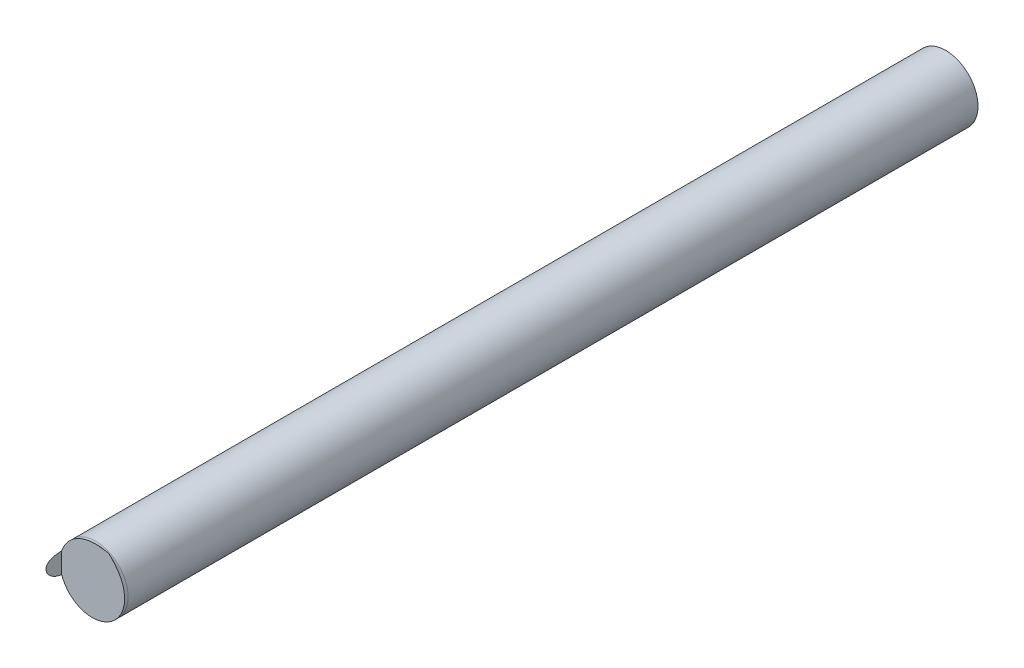
ISO-10303-21;
HEADER;
FILE_DESCRIPTION(('STEP AP214'),'2;1');
FILE_NAME('part.step','',(''),(''),'','','');
FILE_SCHEMA(('AUTOMOTIVE_DESIGN { 1 0 10303 214 1 1 1 1 }'));
ENDSEC;
DATA;
#1=APPLICATION_CONTEXT('core data for automotive mechanical design processes');
#2=APPLICATION_PROTOCOL_DEFINITION('international standard','automotive_design',2000,#1);
#3=PRODUCT_CONTEXT('',#1,'mechanical');
#4=PRODUCT('Part','Part','',(#3));
#5=PRODUCT_RELATED_PRODUCT_CATEGORY('part','',(#4));
#6=PRODUCT_DEFINITION_FORMATION('','',#4);
#7=PRODUCT_DEFINITION_CONTEXT('part definition',#1,'design');
#8=PRODUCT_DEFINITION('design','',#6,#7);
#9=PRODUCT_DEFINITION_SHAPE('','',#8);
#10=(LENGTH_UNIT() NAMED_UNIT(*) SI_UNIT(.MILLI.,.METRE.));
#11=(NAMED_UNIT(*) PLANE_ANGLE_UNIT() SI_UNIT($,.RADIAN.));
#12=(NAMED_UNIT(*) SI_UNIT($,.STERADIAN.) SOLID_ANGLE_UNIT());
#13=UNCERTAINTY_MEASURE_WITH_UNIT(LENGTH_MEASURE(1.E-05),#10,'distance_accuracy_value','');
#14=(GEOMETRIC_REPRESENTATION_CONTEXT(3) GLOBAL_UNCERTAINTY_ASSIGNED_CONTEXT((#13)) GLOBAL_UNIT_ASSIGNED_CONTEXT((#10,
#11,#12)) REPRESENTATION_CONTEXT('',''));
#15=CARTESIAN_POINT('',(0.,0.,0.));
#16=DIRECTION('',(0.,0.,1.));
#17=DIRECTION('',(1.,0.,0.));
#18=AXIS2_PLACEMENT_3D('',#15,#16,#17);
#19=CARTESIAN_POINT('',(-2.52706250659335,0.304851094896286,-7.3152));
#20=DIRECTION('',(0.,0.,-1.));
#21=DIRECTION('',(-1.,0.,0.));
#22=AXIS2_PLACEMENT_3D('',#19,#20,#21);
#23=PLANE('',#22);
#24=CARTESIAN_POINT('',(-2.52706250659335,0.304851094896286,-7.3152));
#25=DIRECTION('',(0.,0.,1.));
#26=DIRECTION('',(0.467775560933805,0.88384728578701,0.));
#27=AXIS2_PLACEMENT_3D('',#24,#25,#26);
#28=CIRCLE('',#27,0.2286);
#29=CARTESIAN_POINT('',(-2.42012901336388,0.506898584427196,-7.3152));
#30=VERTEX_POINT('',#29);
#31=EDGE_CURVE('E51',#30,#30,#28,.T.);
#32=ORIENTED_EDGE('',*,*,#31,.F.);
#33=EDGE_LOOP('',(#32));
#34=FACE_BOUND('',#33,.T.);
#35=ADVANCED_FACE('F16',(#34),#23,.T.);
#36=CARTESIAN_POINT('',(-2.52706250659335,0.304851094896286,-1.175004));
#37=DIRECTION('',(0.,0.,1.));
#38=DIRECTION('',(1.,0.,0.));
#39=AXIS2_PLACEMENT_3D('',#36,#37,#38);
#40=CYLINDRICAL_SURFACE('',#39,0.2286);
#41=CARTESIAN_POINT('',(-2.52706250659335,0.304851094896286,-1.2954));
#42=DIRECTION('',(0.,0.,1.));
#43=DIRECTION('',(-0.467775560933805,-0.88384728578701,0.));
#44=AXIS2_PLACEMENT_3D('',#41,#42,#43);
#45=CIRCLE('',#44,0.2286);
#46=CARTESIAN_POINT('',(-2.63399599982282,0.102803605365376,-1.2954));
#47=VERTEX_POINT('',#46);
#48=EDGE_CURVE('E48',#47,#47,#45,.T.);
#49=ORIENTED_EDGE('',*,*,#48,.F.);
#50=EDGE_LOOP('',(#49));
#51=FACE_BOUND('',#50,.T.);
#52=ORIENTED_EDGE('',*,*,#31,.T.);
#53=EDGE_LOOP('',(#52));
#54=FACE_BOUND('',#53,.T.);
#55=ADVANCED_FACE('F79',(#51,#54),#40,.T.);
#56=CARTESIAN_POINT('',(-2.7432,0.305444522718064,-1.21433725593099));
#57=DIRECTION('',(1.,0.,0.));
#58=DIRECTION('',(0.,0.,-1.));
#59=AXIS2_PLACEMENT_3D('',#56,#57,#58);
#60=PLANE('',#59);
#61=DIRECTION('',(1.44277346675194E-06,-0.999999999998959,0.));
#62=VECTOR('',#61,1.);
#63=CARTESIAN_POINT('',(-2.7432,0.378755047888186,-1.27));
#64=LINE('',#63,#62);
#65=CARTESIAN_POINT('',(-2.7432,0.378755047888186,-1.27));
#66=VERTEX_POINT('',#65);
#67=CARTESIAN_POINT('',(-2.74319978845864,0.232134069019859,-1.27));
#68=VERTEX_POINT('',#67);
#69=EDGE_CURVE('E29',#66,#68,#64,.T.);
#70=ORIENTED_EDGE('',*,*,#69,.F.);
#71=CARTESIAN_POINT('',(-2.7432,0.378755047888186,-1.27));
#72=CARTESIAN_POINT('',(-2.7432,0.378449336977638,-1.26306822146201));
#73=CARTESIAN_POINT('',(-2.7432,0.377593387648138,-1.24996852876635));
#74=CARTESIAN_POINT('',(-2.7432,0.375619090815434,-1.23269632173501));
#75=CARTESIAN_POINT('',(-2.7432,0.372942383990296,-1.21753901620971));
#76=CARTESIAN_POINT('',(-2.7432,0.369549418818404,-1.20434708733987));
#77=CARTESIAN_POINT('',(-2.7432,0.365455102225748,-1.19303346853967));
#78=CARTESIAN_POINT('',(-2.7432,0.360728343474306,-1.18356659739877));
#79=CARTESIAN_POINT('',(-2.7432,0.355532722964374,-1.17593068872193));
#80=CARTESIAN_POINT('',(-2.7432,0.349943584335714,-1.16988342833057));
#81=CARTESIAN_POINT('',(-2.7432,0.343893573841652,-1.16516233136994));
#82=CARTESIAN_POINT('',(-2.7432,0.337326491277088,-1.16167407889459));
#83=CARTESIAN_POINT('',(-2.7432,0.330177005454676,-1.15940901977829));
#84=CARTESIAN_POINT('',(-2.7432,0.322341812542924,-1.15844943327913));
#85=CARTESIAN_POINT('',(-2.74320000000254,0.31385731485587,-1.15895584119087));
#86=CARTESIAN_POINT('',(-2.74319999998984,0.304622840047742,-1.16114772258205));
#87=CARTESIAN_POINT('',(-2.74320000003556,0.294655973920554,-1.1653514887168));
#88=CARTESIAN_POINT('',(-2.74319999986538,0.28419364263647,-1.17184036550915));
#89=CARTESIAN_POINT('',(-2.74320000050546,0.27343395662858,-1.18093468602557));
#90=CARTESIAN_POINT('',(-2.74319999811024,0.262704534119472,-1.19292912477554));
#91=CARTESIAN_POINT('',(-2.7432000070485,0.252406986267924,-1.20818433724524));
#92=CARTESIAN_POINT('',(-2.74319997369322,0.243338916168946,-1.22648763833021));
#93=CARTESIAN_POINT('',(-2.74320009817608,0.236236367468535,-1.24734045193107));
#94=CARTESIAN_POINT('',(-2.74319978845864,0.233200415772124,-1.26223642622822));
#95=CARTESIAN_POINT('',(-2.74319978845864,0.232134069019859,-1.27));
#96=B_SPLINE_CURVE_WITH_KNOTS('',3,(#71,#72,#73,#74,#75,#76,#77,#78,#79,#80,#81,#82,#83,#84,#85,
#86,#87,#88,#89,#90,#91,#92,#93,#94,#95),.UNSPECIFIED.,.F.,.F.,(4,1,1,1,1,1,1,1,1,1,1,1,1,1,1,1,
1,1,1,1,1,1,4),(0.,0.04545454545455,0.09090909090909,0.1363636363636,0.1818181818182,
0.2272727272727,0.2727272727273,0.3181818181818,0.3636363636364,0.4090909090909,0.4545454545455,
0.5,0.5454545454545,0.5909090909091,0.6363636363636,0.6818181818182,0.7272727272727,
0.7727272727273,0.8181818181818,0.8636363636364,0.9090909090909,0.9545454545455,1.),.UNSPECIFIED.);
#97=EDGE_CURVE('E11',#66,#68,#96,.T.);
#98=ORIENTED_EDGE('',*,*,#97,.T.);
#99=EDGE_LOOP('',(#70,#98));
#100=FACE_BOUND('',#99,.T.);
#101=ADVANCED_FACE('F77',(#100),#60,.T.);
#102=CARTESIAN_POINT('',(-2.52028495972886,0.308363673236368,-1.27));
#103=DIRECTION('',(0.,0.,1.));
#104=DIRECTION('',(1.,0.,0.));
#105=AXIS2_PLACEMENT_3D('',#102,#103,#104);
#106=PLANE('',#105);
#107=CARTESIAN_POINT('',(-2.7432,0.378755047888186,-1.27));
#108=CARTESIAN_POINT('',(-2.74024430955884,0.387519009783646,-1.27));
#109=CARTESIAN_POINT('',(-2.73332822413272,0.404561141289358,-1.27));
#110=CARTESIAN_POINT('',(-2.71992094010406,0.428820329000502,-1.27));
#111=CARTESIAN_POINT('',(-2.70366818166984,0.451359465569078,-1.27));
#112=CARTESIAN_POINT('',(-2.6847661193445,0.4718935907804,-1.27));
#113=CARTESIAN_POINT('',(-2.66337316504134,0.490171529243754,-1.27));
#114=CARTESIAN_POINT('',(-2.63997526136988,0.505776745116064,-1.27));
#115=CARTESIAN_POINT('',(-2.61437229624876,0.518831250327296,-1.27));
#116=CARTESIAN_POINT('',(-2.58611170418484,0.529149717547064,-1.27));
#117=CARTESIAN_POINT('',(-2.55795401580894,0.535769145464646,-1.27));
#118=CARTESIAN_POINT('',(-2.5315403603374,0.539136364368498,-1.27));
#119=CARTESIAN_POINT('',(-2.50751229710254,0.54011146891638,-1.27));
#120=CARTESIAN_POINT('',(-2.48462893683125,0.53943923787578,-1.27));
#121=CARTESIAN_POINT('',(-2.46153384403118,0.537408105221264,-1.27));
#122=CARTESIAN_POINT('',(-2.43690211309128,0.53409685796747,-1.27));
#123=CARTESIAN_POINT('',(-2.41813125277761,0.530994306168776,-1.27));
#124=CARTESIAN_POINT('',(-2.40824751411612,0.529348305486184,-1.27));
#125=B_SPLINE_CURVE_WITH_KNOTS('',3,(#107,#108,#109,#110,#111,#112,#113,#114,#115,#116,#117,
#118,#119,#120,#121,#122,#123,#124),.UNSPECIFIED.,.F.,.F.,(4,1,1,1,1,1,1,1,1,1,1,1,1,1,1,4),(0.,
0.06666666666667,0.1333333333333,0.2,0.2666666666667,0.3333333333333,0.4,0.4666666666667,
0.5333333333333,0.6,0.6666666666667,0.7333333333333,0.8,0.8666666666667,0.9333333333333,1.),.UNSPECIFIED.);
#126=CARTESIAN_POINT('',(-2.40824751411612,0.529348305486184,-1.27));
#127=VERTEX_POINT('',#126);
#128=EDGE_CURVE('E21',#66,#127,#125,.T.);
#129=ORIENTED_EDGE('',*,*,#128,.F.);
#130=ORIENTED_EDGE('',*,*,#69,.T.);
#131=CARTESIAN_POINT('',(-2.74319978845864,0.232134069019859,-1.27));
#132=CARTESIAN_POINT('',(-2.7385222411183,0.218295133511908,-1.27));
#133=CARTESIAN_POINT('',(-2.72675388130734,0.192057443217899,-1.2699999996792));
#134=CARTESIAN_POINT('',(-2.70182655344048,0.156337358820923,-1.27000000112243));
#135=CARTESIAN_POINT('',(-2.67056862075962,0.12602157557796,-1.26999999583059));
#136=CARTESIAN_POINT('',(-2.64657775062868,0.11021927520236,-1.27000000898017));
#137=CARTESIAN_POINT('',(-2.63368311217874,0.103394796776617,-1.27000000898017));
#138=B_SPLINE_CURVE_WITH_KNOTS('',3,(#131,#132,#133,#134,#135,#136,#137),.UNSPECIFIED.,.F.,.F.,
(4,1,1,1,4),(0.,0.25,0.5,0.75,1.),.UNSPECIFIED.);
#139=CARTESIAN_POINT('',(-2.63368311217874,0.103394796776617,-1.27000000898017));
#140=VERTEX_POINT('',#139);
#141=EDGE_CURVE('E47',#68,#140,#138,.T.);
#142=ORIENTED_EDGE('',*,*,#141,.T.);
#143=CARTESIAN_POINT('',(-2.40824751411612,0.529348305486184,-1.27));
#144=CARTESIAN_POINT('',(-2.40087792883347,0.521629748951268,-1.27));
#145=CARTESIAN_POINT('',(-2.38694914322475,0.507004063452634,-1.27));
#146=CARTESIAN_POINT('',(-2.36930069412904,0.487147439183234,-1.27));
#147=CARTESIAN_POINT('',(-2.35441538614813,0.468546003870304,-1.27));
#148=CARTESIAN_POINT('',(-2.34183632977924,0.450705483091676,-1.27));
#149=CARTESIAN_POINT('',(-2.3311038277754,0.43314407820719,-1.27));
#150=CARTESIAN_POINT('',(-2.32187147076161,0.415405790274642,-1.27));
#151=CARTESIAN_POINT('',(-2.31378578533129,0.396650455591584,-1.27));
#152=CARTESIAN_POINT('',(-2.30677021933045,0.376016190311302,-1.27));
#153=CARTESIAN_POINT('',(-2.30107323847195,0.352401373662696,-1.27));
#154=CARTESIAN_POINT('',(-2.29760157029516,0.326345122896206,-1.27));
#155=CARTESIAN_POINT('',(-2.29705947637021,0.29874660774943,-1.27));
#156=CARTESIAN_POINT('',(-2.29987707332936,0.270623383628198,-1.27));
#157=CARTESIAN_POINT('',(-2.305920497862,0.24358492696971,-1.27));
#158=CARTESIAN_POINT('',(-2.3149988395478,0.217716522813734,-1.27));
#159=CARTESIAN_POINT('',(-2.32702231058361,0.193158318536134,-1.27));
#160=CARTESIAN_POINT('',(-2.34191387904324,0.170124746273703,-1.27));
#161=CARTESIAN_POINT('',(-2.35932839132108,0.149136803142536,-1.27));
#162=CARTESIAN_POINT('',(-2.3791187106761,0.13033916681482,-1.27));
#163=CARTESIAN_POINT('',(-2.400919585788,0.11407113686235,-1.27));
#164=CARTESIAN_POINT('',(-2.42453527639067,0.10047280021666,-1.27000000000051));
#165=CARTESIAN_POINT('',(-2.449526652118,0.0897971087299598,-1.26999999999848));
#166=CARTESIAN_POINT('',(-2.47563801360612,0.0821453514092988,-1.27000000000584));
#167=CARTESIAN_POINT('',(-2.50242342496407,0.0776492839223052,-1.26999999997841));
#168=CARTESIAN_POINT('',(-2.52957691469178,0.0763548780604744,-1.27000000008026));
#169=CARTESIAN_POINT('',(-2.55666590430846,0.078286386084141,-1.26999999970079));
#170=CARTESIAN_POINT('',(-2.5833402725014,0.0834107293592338,-1.27000000111684));
#171=CARTESIAN_POINT('',(-2.60923494733882,0.091671620994085,-1.26999999583237));
#172=CARTESIAN_POINT('',(-2.6256582841441,0.0991476621238372,-1.27000000898017));
#173=CARTESIAN_POINT('',(-2.63368311217874,0.103394796776617,-1.27000000898017));
#174=B_SPLINE_CURVE_WITH_KNOTS('',3,(#143,#144,#145,#146,#147,#148,#149,#150,#151,#152,#153,
#154,#155,#156,#157,#158,#159,#160,#161,#162,#163,#164,#165,#166,#167,#168,#169,#170,#171,#172,
#173),.UNSPECIFIED.,.F.,.F.,(4,1,1,1,1,1,1,1,1,1,1,1,1,1,1,1,1,1,1,1,1,1,1,1,1,1,1,1,4),(0.,
0.03571428571429,0.07142857142857,0.1071428571429,0.1428571428571,0.1785714285714,
0.2142857142857,0.25,0.2857142857143,0.3214285714286,0.3571428571429,0.3928571428571,
0.4285714285714,0.4642857142857,0.5,0.5357142857143,0.5714285714286,0.6071428571429,
0.6428571428571,0.6785714285714,0.7142857142857,0.75,0.7857142857143,0.8214285714286,
0.8571428571429,0.8928571428571,0.9285714285714,0.9642857142857,1.),.UNSPECIFIED.);
#175=EDGE_CURVE('E44',#127,#140,#174,.T.);
#176=ORIENTED_EDGE('',*,*,#175,.F.);
#177=EDGE_LOOP('',(#129,#130,#142,#176));
#178=FACE_BOUND('',#177,.T.);
#179=ADVANCED_FACE('F46',(#178),#106,.T.);
#180=CARTESIAN_POINT('',(-2.40824751411612,0.529348305486184,-1.2954));
#181=DIRECTION('',(0.88384728578701,-0.467775560933805,0.));
#182=DIRECTION('',(0.,0.,-1.));
#183=AXIS2_PLACEMENT_3D('',#180,#181,#182);
#184=TOROIDAL_SURFACE('',#183,0.254,0.2286);
#185=ORIENTED_EDGE('',*,*,#128,.T.);
#186=ORIENTED_EDGE('',*,*,#175,.T.);
#187=ORIENTED_EDGE('',*,*,#141,.F.);
#188=ORIENTED_EDGE('',*,*,#97,.F.);
#189=EDGE_LOOP('',(#185,#186,#187,#188));
#190=FACE_BOUND('',#189,.T.);
#191=ORIENTED_EDGE('',*,*,#48,.T.);
#192=EDGE_LOOP('',(#191));
#193=FACE_BOUND('',#192,.T.);
#194=ADVANCED_FACE('F18',(#190,#193),#184,.T.);
#195=CLOSED_SHELL('',(#35,#55,#101,#179,#194));
#196=MANIFOLD_SOLID_BREP('B1',#195);
#197=ADVANCED_BREP_SHAPE_REPRESENTATION('',(#18,#196),#14);
#198=SHAPE_DEFINITION_REPRESENTATION(#9,#197);
ENDSEC;
END-ISO-10303-21;
